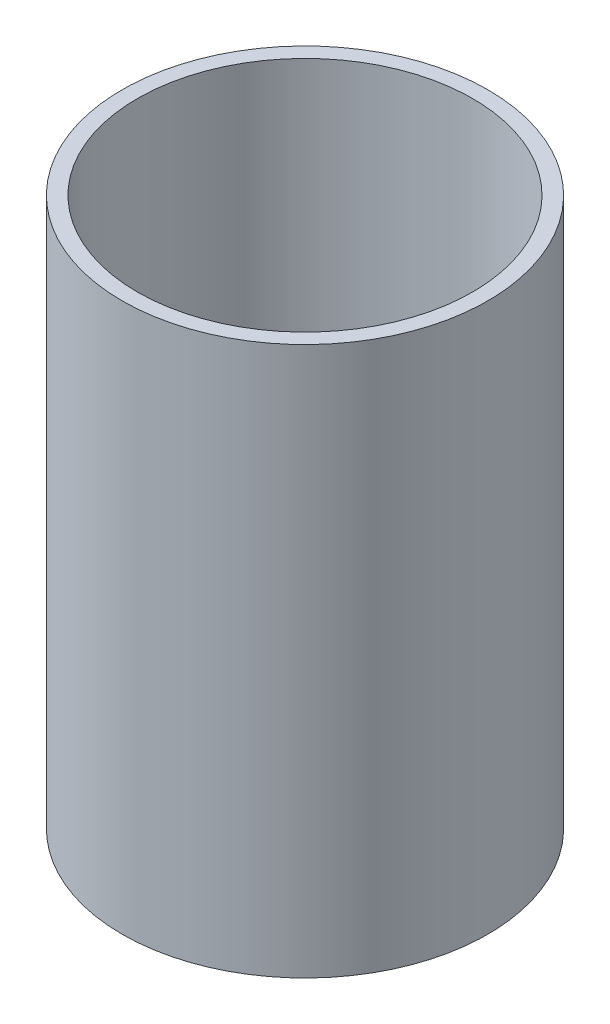
ISO-10303-21;
HEADER;
FILE_DESCRIPTION(('STEP AP214'),'2;1');
FILE_NAME('part.step','',(''),(''),'','','');
FILE_SCHEMA(('AUTOMOTIVE_DESIGN { 1 0 10303 214 1 1 1 1 }'));
ENDSEC;
DATA;
#1=APPLICATION_CONTEXT('core data for automotive mechanical design processes');
#2=APPLICATION_PROTOCOL_DEFINITION('international standard','automotive_design',2000,#1);
#3=PRODUCT_CONTEXT('',#1,'mechanical');
#4=PRODUCT('Part','Part','',(#3));
#5=PRODUCT_RELATED_PRODUCT_CATEGORY('part','',(#4));
#6=PRODUCT_DEFINITION_FORMATION('','',#4);
#7=PRODUCT_DEFINITION_CONTEXT('part definition',#1,'design');
#8=PRODUCT_DEFINITION('design','',#6,#7);
#9=PRODUCT_DEFINITION_SHAPE('','',#8);
#10=(LENGTH_UNIT() NAMED_UNIT(*) SI_UNIT(.MILLI.,.METRE.));
#11=(NAMED_UNIT(*) PLANE_ANGLE_UNIT() SI_UNIT($,.RADIAN.));
#12=(NAMED_UNIT(*) SI_UNIT($,.STERADIAN.) SOLID_ANGLE_UNIT());
#13=UNCERTAINTY_MEASURE_WITH_UNIT(LENGTH_MEASURE(1.E-05),#10,'distance_accuracy_value','');
#14=(GEOMETRIC_REPRESENTATION_CONTEXT(3) GLOBAL_UNCERTAINTY_ASSIGNED_CONTEXT((#13)) GLOBAL_UNIT_ASSIGNED_CONTEXT((#10,
#11,#12)) REPRESENTATION_CONTEXT('',''));
#15=CARTESIAN_POINT('',(0.,0.,0.));
#16=DIRECTION('',(0.,0.,1.));
#17=DIRECTION('',(1.,0.,0.));
#18=AXIS2_PLACEMENT_3D('',#15,#16,#17);
#19=CARTESIAN_POINT('',(0.,914.4,0.));
#20=DIRECTION('',(0.,-1.,0.));
#21=DIRECTION('',(0.,0.,-1.));
#22=AXIS2_PLACEMENT_3D('',#19,#20,#21);
#23=CYLINDRICAL_SURFACE('',#22,304.8);
#24=CARTESIAN_POINT('',(0.,914.4,0.));
#25=DIRECTION('',(0.,1.,0.));
#26=DIRECTION('',(0.,0.,1.));
#27=AXIS2_PLACEMENT_3D('',#24,#25,#26);
#28=CIRCLE('',#27,304.8);
#29=CARTESIAN_POINT('',(0.,914.4,304.8));
#30=VERTEX_POINT('',#29);
#31=EDGE_CURVE('E12',#30,#30,#28,.T.);
#32=ORIENTED_EDGE('',*,*,#31,.F.);
#33=EDGE_LOOP('',(#32));
#34=FACE_BOUND('',#33,.T.);
#35=CARTESIAN_POINT('',(0.,0.,0.));
#36=DIRECTION('',(0.,1.,0.));
#37=DIRECTION('',(0.,0.,1.));
#38=AXIS2_PLACEMENT_3D('',#35,#36,#37);
#39=CIRCLE('',#38,304.8);
#40=CARTESIAN_POINT('',(0.,0.,304.8));
#41=VERTEX_POINT('',#40);
#42=EDGE_CURVE('E81',#41,#41,#39,.T.);
#43=ORIENTED_EDGE('',*,*,#42,.T.);
#44=EDGE_LOOP('',(#43));
#45=FACE_BOUND('',#44,.T.);
#46=ADVANCED_FACE('F78',(#34,#45),#23,.T.);
#47=CARTESIAN_POINT('',(0.,914.4,0.));
#48=DIRECTION('',(0.,1.,0.));
#49=DIRECTION('',(0.,0.,1.));
#50=AXIS2_PLACEMENT_3D('',#47,#48,#49);
#51=PLANE('',#50);
#52=CARTESIAN_POINT('',(0.,914.4,0.));
#53=DIRECTION('',(0.,1.,0.));
#54=DIRECTION('',(0.,0.,1.));
#55=AXIS2_PLACEMENT_3D('',#52,#53,#54);
#56=CIRCLE('',#55,279.4);
#57=CARTESIAN_POINT('',(0.,914.4,279.4));
#58=VERTEX_POINT('',#57);
#59=EDGE_CURVE('E92',#58,#58,#56,.T.);
#60=ORIENTED_EDGE('',*,*,#59,.F.);
#61=EDGE_LOOP('',(#60));
#62=FACE_BOUND('',#61,.T.);
#63=ORIENTED_EDGE('',*,*,#31,.T.);
#64=EDGE_LOOP('',(#63));
#65=FACE_BOUND('',#64,.T.);
#66=ADVANCED_FACE('F121',(#62,#65),#51,.T.);
#67=CARTESIAN_POINT('',(0.,0.,0.));
#68=DIRECTION('',(0.,1.,0.));
#69=DIRECTION('',(0.,0.,1.));
#70=AXIS2_PLACEMENT_3D('',#67,#68,#69);
#71=PLANE('',#70);
#72=CARTESIAN_POINT('',(0.,0.,0.));
#73=DIRECTION('',(0.,-1.,0.));
#74=DIRECTION('',(0.,0.,-1.));
#75=AXIS2_PLACEMENT_3D('',#72,#73,#74);
#76=CIRCLE('',#75,12.7);
#77=CARTESIAN_POINT('',(0.,0.,-12.7));
#78=VERTEX_POINT('',#77);
#79=EDGE_CURVE('E100',#78,#78,#76,.T.);
#80=ORIENTED_EDGE('',*,*,#79,.F.);
#81=EDGE_LOOP('',(#80));
#82=FACE_BOUND('',#81,.T.);
#83=ORIENTED_EDGE('',*,*,#42,.F.);
#84=EDGE_LOOP('',(#83));
#85=FACE_BOUND('',#84,.T.);
#86=ADVANCED_FACE('F117',(#82,#85),#71,.F.);
#87=CARTESIAN_POINT('',(0.,25.3999999999999,0.));
#88=DIRECTION('',(0.,1.,0.));
#89=DIRECTION('',(0.,0.,1.));
#90=AXIS2_PLACEMENT_3D('',#87,#88,#89);
#91=CYLINDRICAL_SURFACE('',#90,279.4);
#92=CARTESIAN_POINT('',(0.,25.3999999999999,0.));
#93=DIRECTION('',(0.,1.,0.));
#94=DIRECTION('',(0.,0.,1.));
#95=AXIS2_PLACEMENT_3D('',#92,#93,#94);
#96=CIRCLE('',#95,279.4);
#97=CARTESIAN_POINT('',(0.,25.3999999999999,279.4));
#98=VERTEX_POINT('',#97);
#99=EDGE_CURVE('E90',#98,#98,#96,.T.);
#100=ORIENTED_EDGE('',*,*,#99,.F.);
#101=EDGE_LOOP('',(#100));
#102=FACE_BOUND('',#101,.T.);
#103=ORIENTED_EDGE('',*,*,#59,.T.);
#104=EDGE_LOOP('',(#103));
#105=FACE_BOUND('',#104,.T.);
#106=ADVANCED_FACE('F120',(#102,#105),#91,.F.);
#107=CARTESIAN_POINT('',(0.,25.3999999999999,0.));
#108=DIRECTION('',(0.,1.,0.));
#109=DIRECTION('',(0.,0.,1.));
#110=AXIS2_PLACEMENT_3D('',#107,#108,#109);
#111=PLANE('',#110);
#112=CARTESIAN_POINT('',(0.,25.4,0.));
#113=DIRECTION('',(0.,-1.,0.));
#114=DIRECTION('',(0.,0.,-1.));
#115=AXIS2_PLACEMENT_3D('',#112,#113,#114);
#116=CIRCLE('',#115,12.7);
#117=CARTESIAN_POINT('',(0.,25.4,-12.7));
#118=VERTEX_POINT('',#117);
#119=EDGE_CURVE('E96',#118,#118,#116,.T.);
#120=ORIENTED_EDGE('',*,*,#119,.T.);
#121=EDGE_LOOP('',(#120));
#122=FACE_BOUND('',#121,.T.);
#123=ORIENTED_EDGE('',*,*,#99,.T.);
#124=EDGE_LOOP('',(#123));
#125=FACE_BOUND('',#124,.T.);
#126=ADVANCED_FACE('F108',(#122,#125),#111,.T.);
#127=CARTESIAN_POINT('',(0.,25.4,0.));
#128=DIRECTION('',(0.,-1.,0.));
#129=DIRECTION('',(0.,0.,-1.));
#130=AXIS2_PLACEMENT_3D('',#127,#128,#129);
#131=CYLINDRICAL_SURFACE('',#130,12.7);
#132=ORIENTED_EDGE('',*,*,#119,.F.);
#133=EDGE_LOOP('',(#132));
#134=FACE_BOUND('',#133,.T.);
#135=ORIENTED_EDGE('',*,*,#79,.T.);
#136=EDGE_LOOP('',(#135));
#137=FACE_BOUND('',#136,.T.);
#138=ADVANCED_FACE('F111',(#134,#137),#131,.F.);
#139=CLOSED_SHELL('',(#46,#66,#86,#106,#126,#138));
#140=MANIFOLD_SOLID_BREP('B2',#139);
#141=ADVANCED_BREP_SHAPE_REPRESENTATION('',(#18,#140),#14);
#142=SHAPE_DEFINITION_REPRESENTATION(#9,#141);
ENDSEC;
END-ISO-10303-21;
